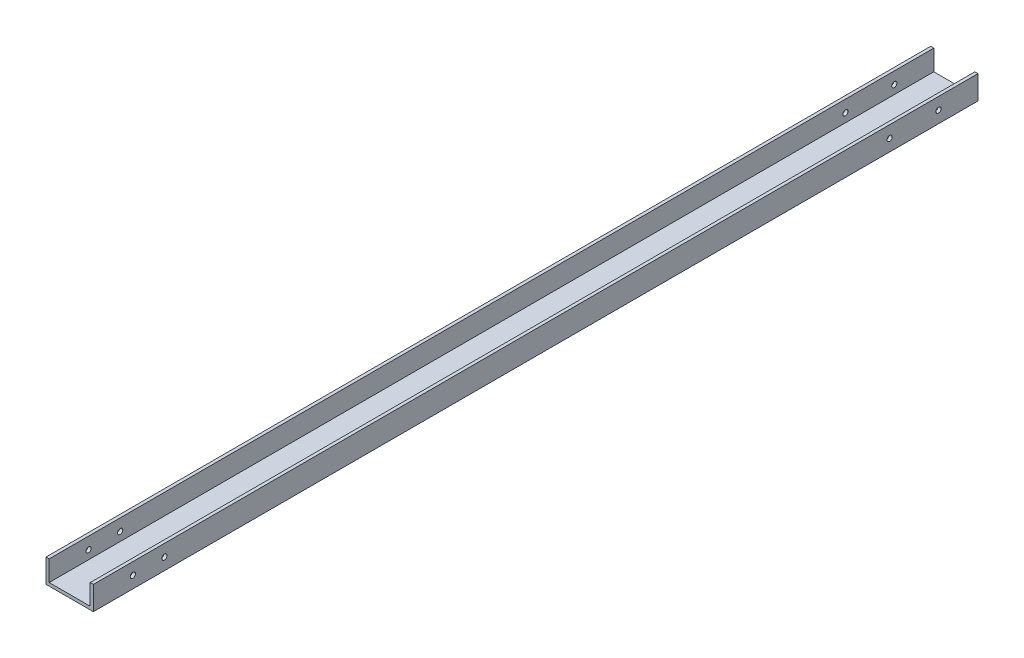
ISO-10303-21;
HEADER;
FILE_DESCRIPTION(('STEP AP214'),'2;1');
FILE_NAME('part.step','',(''),(''),'','','');
FILE_SCHEMA(('AUTOMOTIVE_DESIGN { 1 0 10303 214 1 1 1 1 }'));
ENDSEC;
DATA;
#1=APPLICATION_CONTEXT('core data for automotive mechanical design processes');
#2=APPLICATION_PROTOCOL_DEFINITION('international standard','automotive_design',2000,#1);
#3=PRODUCT_CONTEXT('',#1,'mechanical');
#4=PRODUCT('Part','Part','',(#3));
#5=PRODUCT_RELATED_PRODUCT_CATEGORY('part','',(#4));
#6=PRODUCT_DEFINITION_FORMATION('','',#4);
#7=PRODUCT_DEFINITION_CONTEXT('part definition',#1,'design');
#8=PRODUCT_DEFINITION('design','',#6,#7);
#9=PRODUCT_DEFINITION_SHAPE('','',#8);
#10=(LENGTH_UNIT() NAMED_UNIT(*) SI_UNIT(.MILLI.,.METRE.));
#11=(NAMED_UNIT(*) PLANE_ANGLE_UNIT() SI_UNIT($,.RADIAN.));
#12=(NAMED_UNIT(*) SI_UNIT($,.STERADIAN.) SOLID_ANGLE_UNIT());
#13=UNCERTAINTY_MEASURE_WITH_UNIT(LENGTH_MEASURE(1.E-05),#10,'distance_accuracy_value','');
#14=(GEOMETRIC_REPRESENTATION_CONTEXT(3) GLOBAL_UNCERTAINTY_ASSIGNED_CONTEXT((#13)) GLOBAL_UNIT_ASSIGNED_CONTEXT((#10,
#11,#12)) REPRESENTATION_CONTEXT('',''));
#15=CARTESIAN_POINT('',(0.,0.,0.));
#16=DIRECTION('',(0.,0.,1.));
#17=DIRECTION('',(1.,0.,0.));
#18=AXIS2_PLACEMENT_3D('',#15,#16,#17);
#19=CARTESIAN_POINT('',(15.,0.,560.3));
#20=DIRECTION('',(-1.,0.,0.));
#21=DIRECTION('',(0.,0.,1.));
#22=AXIS2_PLACEMENT_3D('',#19,#20,#21);
#23=PLANE('',#22);
#24=CARTESIAN_POINT('',(15.,7.5,535.3));
#25=DIRECTION('',(1.,0.,0.));
#26=DIRECTION('',(0.,0.,-1.));
#27=AXIS2_PLACEMENT_3D('',#24,#25,#26);
#28=CIRCLE('',#27,1.64999999999999);
#29=CARTESIAN_POINT('',(15.,7.5,533.65));
#30=VERTEX_POINT('',#29);
#31=EDGE_CURVE('E203',#30,#30,#28,.T.);
#32=ORIENTED_EDGE('',*,*,#31,.F.);
#33=EDGE_LOOP('',(#32));
#34=FACE_BOUND('',#33,.T.);
#35=CARTESIAN_POINT('',(15.,7.5,515.3));
#36=DIRECTION('',(1.,0.,0.));
#37=DIRECTION('',(0.,0.,-1.));
#38=AXIS2_PLACEMENT_3D('',#35,#36,#37);
#39=CIRCLE('',#38,1.64999999999999);
#40=CARTESIAN_POINT('',(15.,7.5,513.65));
#41=VERTEX_POINT('',#40);
#42=EDGE_CURVE('E197',#41,#41,#39,.T.);
#43=ORIENTED_EDGE('',*,*,#42,.F.);
#44=EDGE_LOOP('',(#43));
#45=FACE_BOUND('',#44,.T.);
#46=CARTESIAN_POINT('',(15.,7.5,25.));
#47=DIRECTION('',(1.,0.,0.));
#48=DIRECTION('',(0.,0.,-1.));
#49=AXIS2_PLACEMENT_3D('',#46,#47,#48);
#50=CIRCLE('',#49,1.65);
#51=CARTESIAN_POINT('',(15.,7.5,23.35));
#52=VERTEX_POINT('',#51);
#53=EDGE_CURVE('E185',#52,#52,#50,.T.);
#54=ORIENTED_EDGE('',*,*,#53,.F.);
#55=EDGE_LOOP('',(#54));
#56=FACE_BOUND('',#55,.T.);
#57=DIRECTION('',(0.,1.,0.));
#58=VECTOR('',#57,1.);
#59=CARTESIAN_POINT('',(15.,0.,0.));
#60=LINE('',#59,#58);
#61=CARTESIAN_POINT('',(15.,0.,0.));
#62=VERTEX_POINT('',#61);
#63=CARTESIAN_POINT('',(15.,15.,0.));
#64=VERTEX_POINT('',#63);
#65=EDGE_CURVE('E134',#62,#64,#60,.T.);
#66=ORIENTED_EDGE('',*,*,#65,.T.);
#67=DIRECTION('',(0.,0.,-1.));
#68=VECTOR('',#67,1.);
#69=CARTESIAN_POINT('',(15.,15.,560.3));
#70=LINE('',#69,#68);
#71=CARTESIAN_POINT('',(15.,15.,560.3));
#72=VERTEX_POINT('',#71);
#73=EDGE_CURVE('E45',#72,#64,#70,.T.);
#74=ORIENTED_EDGE('',*,*,#73,.F.);
#75=DIRECTION('',(0.,1.,0.));
#76=VECTOR('',#75,1.);
#77=CARTESIAN_POINT('',(15.,0.,560.3));
#78=LINE('',#77,#76);
#79=CARTESIAN_POINT('',(15.,0.,560.3));
#80=VERTEX_POINT('',#79);
#81=EDGE_CURVE('E180',#80,#72,#78,.T.);
#82=ORIENTED_EDGE('',*,*,#81,.F.);
#83=DIRECTION('',(0.,0.,-1.));
#84=VECTOR('',#83,1.);
#85=CARTESIAN_POINT('',(15.,0.,560.3));
#86=LINE('',#85,#84);
#87=EDGE_CURVE('E11',#80,#62,#86,.T.);
#88=ORIENTED_EDGE('',*,*,#87,.T.);
#89=EDGE_LOOP('',(#66,#74,#82,#88));
#90=FACE_BOUND('',#89,.T.);
#91=CARTESIAN_POINT('',(15.,7.49999999999999,56.));
#92=DIRECTION('',(1.,0.,0.));
#93=DIRECTION('',(0.,0.,-1.));
#94=AXIS2_PLACEMENT_3D('',#91,#92,#93);
#95=CIRCLE('',#94,1.65);
#96=CARTESIAN_POINT('',(15.,7.49999999999999,54.35));
#97=VERTEX_POINT('',#96);
#98=EDGE_CURVE('E191',#97,#97,#95,.T.);
#99=ORIENTED_EDGE('',*,*,#98,.F.);
#100=EDGE_LOOP('',(#99));
#101=FACE_BOUND('',#100,.T.);
#102=ADVANCED_FACE('F35',(#34,#45,#56,#90,#101),#23,.F.);
#103=CARTESIAN_POINT('',(0.,0.,560.3));
#104=DIRECTION('',(0.,1.,0.));
#105=DIRECTION('',(0.,0.,1.));
#106=AXIS2_PLACEMENT_3D('',#103,#104,#105);
#107=PLANE('',#106);
#108=DIRECTION('',(1.,0.,0.));
#109=VECTOR('',#108,1.);
#110=CARTESIAN_POINT('',(0.,0.,0.));
#111=LINE('',#110,#109);
#112=CARTESIAN_POINT('',(-15.,0.,0.));
#113=VERTEX_POINT('',#112);
#114=EDGE_CURVE('E89',#113,#62,#111,.T.);
#115=ORIENTED_EDGE('',*,*,#114,.T.);
#116=ORIENTED_EDGE('',*,*,#87,.F.);
#117=DIRECTION('',(1.,0.,0.));
#118=VECTOR('',#117,1.);
#119=CARTESIAN_POINT('',(0.,0.,560.3));
#120=LINE('',#119,#118);
#121=CARTESIAN_POINT('',(-15.,0.,560.3));
#122=VERTEX_POINT('',#121);
#123=EDGE_CURVE('E95',#122,#80,#120,.T.);
#124=ORIENTED_EDGE('',*,*,#123,.F.);
#125=DIRECTION('',(0.,0.,-1.));
#126=VECTOR('',#125,1.);
#127=CARTESIAN_POINT('',(-15.,0.,560.3));
#128=LINE('',#127,#126);
#129=EDGE_CURVE('E129',#122,#113,#128,.T.);
#130=ORIENTED_EDGE('',*,*,#129,.T.);
#131=EDGE_LOOP('',(#115,#116,#124,#130));
#132=FACE_BOUND('',#131,.T.);
#133=ADVANCED_FACE('F37',(#132),#107,.F.);
#134=CARTESIAN_POINT('',(15.,15.,560.3));
#135=DIRECTION('',(0.,-1.,0.));
#136=DIRECTION('',(0.,0.,-1.));
#137=AXIS2_PLACEMENT_3D('',#134,#135,#136);
#138=PLANE('',#137);
#139=DIRECTION('',(-1.,0.,0.));
#140=VECTOR('',#139,1.);
#141=CARTESIAN_POINT('',(15.,15.,0.));
#142=LINE('',#141,#140);
#143=CARTESIAN_POINT('',(13.,15.,0.));
#144=VERTEX_POINT('',#143);
#145=EDGE_CURVE('E137',#64,#144,#142,.T.);
#146=ORIENTED_EDGE('',*,*,#145,.T.);
#147=DIRECTION('',(0.,0.,-1.));
#148=VECTOR('',#147,1.);
#149=CARTESIAN_POINT('',(13.,15.,560.3));
#150=LINE('',#149,#148);
#151=CARTESIAN_POINT('',(13.,15.,560.3));
#152=VERTEX_POINT('',#151);
#153=EDGE_CURVE('E154',#152,#144,#150,.T.);
#154=ORIENTED_EDGE('',*,*,#153,.F.);
#155=DIRECTION('',(-1.,0.,0.));
#156=VECTOR('',#155,1.);
#157=CARTESIAN_POINT('',(15.,15.,560.3));
#158=LINE('',#157,#156);
#159=EDGE_CURVE('E164',#72,#152,#158,.T.);
#160=ORIENTED_EDGE('',*,*,#159,.F.);
#161=ORIENTED_EDGE('',*,*,#73,.T.);
#162=EDGE_LOOP('',(#146,#154,#160,#161));
#163=FACE_BOUND('',#162,.T.);
#164=ADVANCED_FACE('F162',(#163),#138,.F.);
#165=CARTESIAN_POINT('',(13.,15.,560.3));
#166=DIRECTION('',(1.,0.,0.));
#167=DIRECTION('',(0.,1.,0.));
#168=AXIS2_PLACEMENT_3D('',#165,#166,#167);
#169=PLANE('',#168);
#170=CARTESIAN_POINT('',(13.,7.5,535.3));
#171=DIRECTION('',(1.,0.,0.));
#172=DIRECTION('',(0.,1.,0.));
#173=AXIS2_PLACEMENT_3D('',#170,#171,#172);
#174=CIRCLE('',#173,1.64999999999999);
#175=CARTESIAN_POINT('',(13.,9.14999999999999,535.3));
#176=VERTEX_POINT('',#175);
#177=EDGE_CURVE('E200',#176,#176,#174,.T.);
#178=ORIENTED_EDGE('',*,*,#177,.T.);
#179=EDGE_LOOP('',(#178));
#180=FACE_BOUND('',#179,.T.);
#181=CARTESIAN_POINT('',(13.,7.5,515.3));
#182=DIRECTION('',(1.,0.,0.));
#183=DIRECTION('',(0.,1.,0.));
#184=AXIS2_PLACEMENT_3D('',#181,#182,#183);
#185=CIRCLE('',#184,1.64999999999999);
#186=CARTESIAN_POINT('',(13.,9.14999999999999,515.3));
#187=VERTEX_POINT('',#186);
#188=EDGE_CURVE('E194',#187,#187,#185,.T.);
#189=ORIENTED_EDGE('',*,*,#188,.T.);
#190=EDGE_LOOP('',(#189));
#191=FACE_BOUND('',#190,.T.);
#192=CARTESIAN_POINT('',(13.,7.49999999999999,56.));
#193=DIRECTION('',(1.,0.,0.));
#194=DIRECTION('',(0.,1.,0.));
#195=AXIS2_PLACEMENT_3D('',#192,#193,#194);
#196=CIRCLE('',#195,1.65);
#197=CARTESIAN_POINT('',(13.,9.14999999999999,56.));
#198=VERTEX_POINT('',#197);
#199=EDGE_CURVE('E188',#198,#198,#196,.T.);
#200=ORIENTED_EDGE('',*,*,#199,.T.);
#201=EDGE_LOOP('',(#200));
#202=FACE_BOUND('',#201,.T.);
#203=CARTESIAN_POINT('',(13.,7.5,25.));
#204=DIRECTION('',(1.,0.,0.));
#205=DIRECTION('',(0.,1.,0.));
#206=AXIS2_PLACEMENT_3D('',#203,#204,#205);
#207=CIRCLE('',#206,1.65);
#208=CARTESIAN_POINT('',(13.,9.15,25.));
#209=VERTEX_POINT('',#208);
#210=EDGE_CURVE('E135',#209,#209,#207,.T.);
#211=ORIENTED_EDGE('',*,*,#210,.T.);
#212=EDGE_LOOP('',(#211));
#213=FACE_BOUND('',#212,.T.);
#214=DIRECTION('',(0.,-1.,0.));
#215=VECTOR('',#214,1.);
#216=CARTESIAN_POINT('',(13.,15.,0.));
#217=LINE('',#216,#215);
#218=CARTESIAN_POINT('',(13.,2.,0.));
#219=VERTEX_POINT('',#218);
#220=EDGE_CURVE('E139',#144,#219,#217,.T.);
#221=ORIENTED_EDGE('',*,*,#220,.T.);
#222=DIRECTION('',(0.,0.,-1.));
#223=VECTOR('',#222,1.);
#224=CARTESIAN_POINT('',(13.,2.,560.3));
#225=LINE('',#224,#223);
#226=CARTESIAN_POINT('',(13.,2.,560.3));
#227=VERTEX_POINT('',#226);
#228=EDGE_CURVE('E151',#227,#219,#225,.T.);
#229=ORIENTED_EDGE('',*,*,#228,.F.);
#230=DIRECTION('',(0.,-1.,0.));
#231=VECTOR('',#230,1.);
#232=CARTESIAN_POINT('',(13.,15.,560.3));
#233=LINE('',#232,#231);
#234=EDGE_CURVE('E176',#152,#227,#233,.T.);
#235=ORIENTED_EDGE('',*,*,#234,.F.);
#236=ORIENTED_EDGE('',*,*,#153,.T.);
#237=EDGE_LOOP('',(#221,#229,#235,#236));
#238=FACE_BOUND('',#237,.T.);
#239=ADVANCED_FACE('F172',(#180,#191,#202,#213,#238),#169,.F.);
#240=CARTESIAN_POINT('',(-13.,2.,560.3));
#241=DIRECTION('',(0.,-1.,0.));
#242=DIRECTION('',(1.,0.,0.));
#243=AXIS2_PLACEMENT_3D('',#240,#241,#242);
#244=PLANE('',#243);
#245=DIRECTION('',(-1.,0.,0.));
#246=VECTOR('',#245,1.);
#247=CARTESIAN_POINT('',(-13.,2.,0.));
#248=LINE('',#247,#246);
#249=CARTESIAN_POINT('',(-13.,2.,0.));
#250=VERTEX_POINT('',#249);
#251=EDGE_CURVE('E141',#219,#250,#248,.T.);
#252=ORIENTED_EDGE('',*,*,#251,.T.);
#253=DIRECTION('',(0.,0.,-1.));
#254=VECTOR('',#253,1.);
#255=CARTESIAN_POINT('',(-13.,2.,560.3));
#256=LINE('',#255,#254);
#257=CARTESIAN_POINT('',(-13.,2.,560.3));
#258=VERTEX_POINT('',#257);
#259=EDGE_CURVE('E124',#258,#250,#256,.T.);
#260=ORIENTED_EDGE('',*,*,#259,.F.);
#261=DIRECTION('',(-1.,0.,0.));
#262=VECTOR('',#261,1.);
#263=CARTESIAN_POINT('',(-13.,2.,560.3));
#264=LINE('',#263,#262);
#265=EDGE_CURVE('E115',#227,#258,#264,.T.);
#266=ORIENTED_EDGE('',*,*,#265,.F.);
#267=ORIENTED_EDGE('',*,*,#228,.T.);
#268=EDGE_LOOP('',(#252,#260,#266,#267));
#269=FACE_BOUND('',#268,.T.);
#270=ADVANCED_FACE('F175',(#269),#244,.F.);
#271=CARTESIAN_POINT('',(-13.,15.,560.3));
#272=DIRECTION('',(-1.,0.,0.));
#273=DIRECTION('',(0.,0.,1.));
#274=AXIS2_PLACEMENT_3D('',#271,#272,#273);
#275=PLANE('',#274);
#276=CARTESIAN_POINT('',(-13.,7.49999999999999,56.));
#277=DIRECTION('',(-1.,0.,0.));
#278=DIRECTION('',(0.,0.,1.));
#279=AXIS2_PLACEMENT_3D('',#276,#277,#278);
#280=CIRCLE('',#279,1.64999999999999);
#281=CARTESIAN_POINT('',(-13.,7.49999999999999,57.65));
#282=VERTEX_POINT('',#281);
#283=EDGE_CURVE('E221',#282,#282,#280,.T.);
#284=ORIENTED_EDGE('',*,*,#283,.T.);
#285=EDGE_LOOP('',(#284));
#286=FACE_BOUND('',#285,.T.);
#287=CARTESIAN_POINT('',(-13.,7.5,25.));
#288=DIRECTION('',(-1.,0.,0.));
#289=DIRECTION('',(0.,0.,1.));
#290=AXIS2_PLACEMENT_3D('',#287,#288,#289);
#291=CIRCLE('',#290,1.64999999999999);
#292=CARTESIAN_POINT('',(-13.,7.5,26.65));
#293=VERTEX_POINT('',#292);
#294=EDGE_CURVE('E215',#293,#293,#291,.T.);
#295=ORIENTED_EDGE('',*,*,#294,.T.);
#296=EDGE_LOOP('',(#295));
#297=FACE_BOUND('',#296,.T.);
#298=CARTESIAN_POINT('',(-13.,7.5,515.3));
#299=DIRECTION('',(-1.,0.,0.));
#300=DIRECTION('',(0.,0.,1.));
#301=AXIS2_PLACEMENT_3D('',#298,#299,#300);
#302=CIRCLE('',#301,1.64999999999999);
#303=CARTESIAN_POINT('',(-13.,7.5,516.95));
#304=VERTEX_POINT('',#303);
#305=EDGE_CURVE('E39',#304,#304,#302,.T.);
#306=ORIENTED_EDGE('',*,*,#305,.T.);
#307=EDGE_LOOP('',(#306));
#308=FACE_BOUND('',#307,.T.);
#309=CARTESIAN_POINT('',(-13.,7.5,535.3));
#310=DIRECTION('',(-1.,0.,0.));
#311=DIRECTION('',(0.,0.,1.));
#312=AXIS2_PLACEMENT_3D('',#309,#310,#311);
#313=CIRCLE('',#312,1.64999999999999);
#314=CARTESIAN_POINT('',(-13.,7.5,536.95));
#315=VERTEX_POINT('',#314);
#316=EDGE_CURVE('E206',#315,#315,#313,.T.);
#317=ORIENTED_EDGE('',*,*,#316,.T.);
#318=EDGE_LOOP('',(#317));
#319=FACE_BOUND('',#318,.T.);
#320=DIRECTION('',(0.,1.,0.));
#321=VECTOR('',#320,1.);
#322=CARTESIAN_POINT('',(-13.,15.,0.));
#323=LINE('',#322,#321);
#324=CARTESIAN_POINT('',(-13.,15.,0.));
#325=VERTEX_POINT('',#324);
#326=EDGE_CURVE('E123',#250,#325,#323,.T.);
#327=ORIENTED_EDGE('',*,*,#326,.T.);
#328=DIRECTION('',(0.,0.,-1.));
#329=VECTOR('',#328,1.);
#330=CARTESIAN_POINT('',(-13.,15.,560.3));
#331=LINE('',#330,#329);
#332=CARTESIAN_POINT('',(-13.,15.,560.3));
#333=VERTEX_POINT('',#332);
#334=EDGE_CURVE('E120',#333,#325,#331,.T.);
#335=ORIENTED_EDGE('',*,*,#334,.F.);
#336=DIRECTION('',(0.,1.,0.));
#337=VECTOR('',#336,1.);
#338=CARTESIAN_POINT('',(-13.,15.,560.3));
#339=LINE('',#338,#337);
#340=EDGE_CURVE('E109',#258,#333,#339,.T.);
#341=ORIENTED_EDGE('',*,*,#340,.F.);
#342=ORIENTED_EDGE('',*,*,#259,.T.);
#343=EDGE_LOOP('',(#327,#335,#341,#342));
#344=FACE_BOUND('',#343,.T.);
#345=ADVANCED_FACE('F121',(#286,#297,#308,#319,#344),#275,.F.);
#346=CARTESIAN_POINT('',(-15.,15.,560.3));
#347=DIRECTION('',(0.,-1.,0.));
#348=DIRECTION('',(0.,0.,-1.));
#349=AXIS2_PLACEMENT_3D('',#346,#347,#348);
#350=PLANE('',#349);
#351=DIRECTION('',(-1.,0.,0.));
#352=VECTOR('',#351,1.);
#353=CARTESIAN_POINT('',(-15.,15.,0.));
#354=LINE('',#353,#352);
#355=CARTESIAN_POINT('',(-15.,15.,0.));
#356=VERTEX_POINT('',#355);
#357=EDGE_CURVE('E82',#325,#356,#354,.T.);
#358=ORIENTED_EDGE('',*,*,#357,.T.);
#359=DIRECTION('',(0.,0.,-1.));
#360=VECTOR('',#359,1.);
#361=CARTESIAN_POINT('',(-15.,15.,560.3));
#362=LINE('',#361,#360);
#363=CARTESIAN_POINT('',(-15.,15.,560.3));
#364=VERTEX_POINT('',#363);
#365=EDGE_CURVE('E125',#364,#356,#362,.T.);
#366=ORIENTED_EDGE('',*,*,#365,.F.);
#367=DIRECTION('',(-1.,0.,0.));
#368=VECTOR('',#367,1.);
#369=CARTESIAN_POINT('',(-15.,15.,560.3));
#370=LINE('',#369,#368);
#371=EDGE_CURVE('E113',#333,#364,#370,.T.);
#372=ORIENTED_EDGE('',*,*,#371,.F.);
#373=ORIENTED_EDGE('',*,*,#334,.T.);
#374=EDGE_LOOP('',(#358,#366,#372,#373));
#375=FACE_BOUND('',#374,.T.);
#376=ADVANCED_FACE('F127',(#375),#350,.F.);
#377=CARTESIAN_POINT('',(-15.,0.,560.3));
#378=DIRECTION('',(1.,0.,0.));
#379=DIRECTION('',(0.,0.,-1.));
#380=AXIS2_PLACEMENT_3D('',#377,#378,#379);
#381=PLANE('',#380);
#382=CARTESIAN_POINT('',(-15.,7.49999999999999,56.));
#383=DIRECTION('',(-1.,0.,0.));
#384=DIRECTION('',(0.,0.,1.));
#385=AXIS2_PLACEMENT_3D('',#382,#383,#384);
#386=CIRCLE('',#385,1.64999999999999);
#387=CARTESIAN_POINT('',(-15.,7.49999999999999,57.65));
#388=VERTEX_POINT('',#387);
#389=EDGE_CURVE('E224',#388,#388,#386,.T.);
#390=ORIENTED_EDGE('',*,*,#389,.F.);
#391=EDGE_LOOP('',(#390));
#392=FACE_BOUND('',#391,.T.);
#393=CARTESIAN_POINT('',(-15.,7.5,25.));
#394=DIRECTION('',(-1.,0.,0.));
#395=DIRECTION('',(0.,0.,1.));
#396=AXIS2_PLACEMENT_3D('',#393,#394,#395);
#397=CIRCLE('',#396,1.64999999999999);
#398=CARTESIAN_POINT('',(-15.,7.5,26.65));
#399=VERTEX_POINT('',#398);
#400=EDGE_CURVE('E218',#399,#399,#397,.T.);
#401=ORIENTED_EDGE('',*,*,#400,.F.);
#402=EDGE_LOOP('',(#401));
#403=FACE_BOUND('',#402,.T.);
#404=CARTESIAN_POINT('',(-15.,7.5,515.3));
#405=DIRECTION('',(-1.,0.,0.));
#406=DIRECTION('',(0.,0.,1.));
#407=AXIS2_PLACEMENT_3D('',#404,#405,#406);
#408=CIRCLE('',#407,1.64999999999999);
#409=CARTESIAN_POINT('',(-15.,7.5,516.95));
#410=VERTEX_POINT('',#409);
#411=EDGE_CURVE('E212',#410,#410,#408,.T.);
#412=ORIENTED_EDGE('',*,*,#411,.F.);
#413=EDGE_LOOP('',(#412));
#414=FACE_BOUND('',#413,.T.);
#415=CARTESIAN_POINT('',(-15.,7.5,535.3));
#416=DIRECTION('',(-1.,0.,0.));
#417=DIRECTION('',(0.,0.,1.));
#418=AXIS2_PLACEMENT_3D('',#415,#416,#417);
#419=CIRCLE('',#418,1.64999999999999);
#420=CARTESIAN_POINT('',(-15.,7.5,536.95));
#421=VERTEX_POINT('',#420);
#422=EDGE_CURVE('E209',#421,#421,#419,.T.);
#423=ORIENTED_EDGE('',*,*,#422,.F.);
#424=EDGE_LOOP('',(#423));
#425=FACE_BOUND('',#424,.T.);
#426=DIRECTION('',(0.,-1.,0.));
#427=VECTOR('',#426,1.);
#428=CARTESIAN_POINT('',(-15.,0.,0.));
#429=LINE('',#428,#427);
#430=EDGE_CURVE('E145',#356,#113,#429,.T.);
#431=ORIENTED_EDGE('',*,*,#430,.T.);
#432=ORIENTED_EDGE('',*,*,#129,.F.);
#433=DIRECTION('',(0.,-1.,0.));
#434=VECTOR('',#433,1.);
#435=CARTESIAN_POINT('',(-15.,0.,560.3));
#436=LINE('',#435,#434);
#437=EDGE_CURVE('E53',#364,#122,#436,.T.);
#438=ORIENTED_EDGE('',*,*,#437,.F.);
#439=ORIENTED_EDGE('',*,*,#365,.T.);
#440=EDGE_LOOP('',(#431,#432,#438,#439));
#441=FACE_BOUND('',#440,.T.);
#442=ADVANCED_FACE('F231',(#392,#403,#414,#425,#441),#381,.F.);
#443=CARTESIAN_POINT('',(0.,0.,560.3));
#444=DIRECTION('',(0.,0.,-1.));
#445=DIRECTION('',(-1.,0.,0.));
#446=AXIS2_PLACEMENT_3D('',#443,#444,#445);
#447=PLANE('',#446);
#448=ORIENTED_EDGE('',*,*,#123,.T.);
#449=ORIENTED_EDGE('',*,*,#81,.T.);
#450=ORIENTED_EDGE('',*,*,#159,.T.);
#451=ORIENTED_EDGE('',*,*,#234,.T.);
#452=ORIENTED_EDGE('',*,*,#265,.T.);
#453=ORIENTED_EDGE('',*,*,#340,.T.);
#454=ORIENTED_EDGE('',*,*,#371,.T.);
#455=ORIENTED_EDGE('',*,*,#437,.T.);
#456=EDGE_LOOP('',(#448,#449,#450,#451,#452,#453,#454,#455));
#457=FACE_BOUND('',#456,.T.);
#458=ADVANCED_FACE('F111',(#457),#447,.F.);
#459=CARTESIAN_POINT('',(0.,0.,0.));
#460=DIRECTION('',(0.,0.,-1.));
#461=DIRECTION('',(-1.,0.,0.));
#462=AXIS2_PLACEMENT_3D('',#459,#460,#461);
#463=PLANE('',#462);
#464=ORIENTED_EDGE('',*,*,#114,.F.);
#465=ORIENTED_EDGE('',*,*,#430,.F.);
#466=ORIENTED_EDGE('',*,*,#357,.F.);
#467=ORIENTED_EDGE('',*,*,#326,.F.);
#468=ORIENTED_EDGE('',*,*,#251,.F.);
#469=ORIENTED_EDGE('',*,*,#220,.F.);
#470=ORIENTED_EDGE('',*,*,#145,.F.);
#471=ORIENTED_EDGE('',*,*,#65,.F.);
#472=EDGE_LOOP('',(#464,#465,#466,#467,#468,#469,#470,#471));
#473=FACE_BOUND('',#472,.T.);
#474=ADVANCED_FACE('F168',(#473),#463,.T.);
#475=CARTESIAN_POINT('',(15.,7.5,25.));
#476=DIRECTION('',(1.,0.,0.));
#477=DIRECTION('',(0.,0.,-1.));
#478=AXIS2_PLACEMENT_3D('',#475,#476,#477);
#479=CYLINDRICAL_SURFACE('',#478,1.65);
#480=ORIENTED_EDGE('',*,*,#53,.T.);
#481=EDGE_LOOP('',(#480));
#482=FACE_BOUND('',#481,.T.);
#483=ORIENTED_EDGE('',*,*,#210,.F.);
#484=EDGE_LOOP('',(#483));
#485=FACE_BOUND('',#484,.T.);
#486=ADVANCED_FACE('F251',(#482,#485),#479,.F.);
#487=CARTESIAN_POINT('',(15.,7.49999999999999,56.));
#488=DIRECTION('',(1.,0.,0.));
#489=DIRECTION('',(0.,0.,-1.));
#490=AXIS2_PLACEMENT_3D('',#487,#488,#489);
#491=CYLINDRICAL_SURFACE('',#490,1.65);
#492=ORIENTED_EDGE('',*,*,#98,.T.);
#493=EDGE_LOOP('',(#492));
#494=FACE_BOUND('',#493,.T.);
#495=ORIENTED_EDGE('',*,*,#199,.F.);
#496=EDGE_LOOP('',(#495));
#497=FACE_BOUND('',#496,.T.);
#498=ADVANCED_FACE('F247',(#494,#497),#491,.F.);
#499=CARTESIAN_POINT('',(15.,7.5,515.3));
#500=DIRECTION('',(1.,0.,0.));
#501=DIRECTION('',(0.,0.,-1.));
#502=AXIS2_PLACEMENT_3D('',#499,#500,#501);
#503=CYLINDRICAL_SURFACE('',#502,1.64999999999999);
#504=ORIENTED_EDGE('',*,*,#42,.T.);
#505=EDGE_LOOP('',(#504));
#506=FACE_BOUND('',#505,.T.);
#507=ORIENTED_EDGE('',*,*,#188,.F.);
#508=EDGE_LOOP('',(#507));
#509=FACE_BOUND('',#508,.T.);
#510=ADVANCED_FACE('F250',(#506,#509),#503,.F.);
#511=CARTESIAN_POINT('',(15.,7.5,535.3));
#512=DIRECTION('',(1.,0.,0.));
#513=DIRECTION('',(0.,0.,-1.));
#514=AXIS2_PLACEMENT_3D('',#511,#512,#513);
#515=CYLINDRICAL_SURFACE('',#514,1.64999999999999);
#516=ORIENTED_EDGE('',*,*,#31,.T.);
#517=EDGE_LOOP('',(#516));
#518=FACE_BOUND('',#517,.T.);
#519=ORIENTED_EDGE('',*,*,#177,.F.);
#520=EDGE_LOOP('',(#519));
#521=FACE_BOUND('',#520,.T.);
#522=ADVANCED_FACE('F314',(#518,#521),#515,.F.);
#523=CARTESIAN_POINT('',(-15.,7.5,535.3));
#524=DIRECTION('',(-1.,0.,0.));
#525=DIRECTION('',(0.,0.,1.));
#526=AXIS2_PLACEMENT_3D('',#523,#524,#525);
#527=CYLINDRICAL_SURFACE('',#526,1.64999999999999);
#528=ORIENTED_EDGE('',*,*,#422,.T.);
#529=EDGE_LOOP('',(#528));
#530=FACE_BOUND('',#529,.T.);
#531=ORIENTED_EDGE('',*,*,#316,.F.);
#532=EDGE_LOOP('',(#531));
#533=FACE_BOUND('',#532,.T.);
#534=ADVANCED_FACE('F325',(#530,#533),#527,.F.);
#535=CARTESIAN_POINT('',(-15.,7.5,515.3));
#536=DIRECTION('',(-1.,0.,0.));
#537=DIRECTION('',(0.,0.,1.));
#538=AXIS2_PLACEMENT_3D('',#535,#536,#537);
#539=CYLINDRICAL_SURFACE('',#538,1.64999999999999);
#540=ORIENTED_EDGE('',*,*,#411,.T.);
#541=EDGE_LOOP('',(#540));
#542=FACE_BOUND('',#541,.T.);
#543=ORIENTED_EDGE('',*,*,#305,.F.);
#544=EDGE_LOOP('',(#543));
#545=FACE_BOUND('',#544,.T.);
#546=ADVANCED_FACE('F350',(#542,#545),#539,.F.);
#547=CARTESIAN_POINT('',(-15.,7.5,25.));
#548=DIRECTION('',(-1.,0.,0.));
#549=DIRECTION('',(0.,0.,1.));
#550=AXIS2_PLACEMENT_3D('',#547,#548,#549);
#551=CYLINDRICAL_SURFACE('',#550,1.64999999999999);
#552=ORIENTED_EDGE('',*,*,#400,.T.);
#553=EDGE_LOOP('',(#552));
#554=FACE_BOUND('',#553,.T.);
#555=ORIENTED_EDGE('',*,*,#294,.F.);
#556=EDGE_LOOP('',(#555));
#557=FACE_BOUND('',#556,.T.);
#558=ADVANCED_FACE('F361',(#554,#557),#551,.F.);
#559=CARTESIAN_POINT('',(-15.,7.49999999999999,56.));
#560=DIRECTION('',(-1.,0.,0.));
#561=DIRECTION('',(0.,0.,1.));
#562=AXIS2_PLACEMENT_3D('',#559,#560,#561);
#563=CYLINDRICAL_SURFACE('',#562,1.64999999999999);
#564=ORIENTED_EDGE('',*,*,#389,.T.);
#565=EDGE_LOOP('',(#564));
#566=FACE_BOUND('',#565,.T.);
#567=ORIENTED_EDGE('',*,*,#283,.F.);
#568=EDGE_LOOP('',(#567));
#569=FACE_BOUND('',#568,.T.);
#570=ADVANCED_FACE('F228',(#566,#569),#563,.F.);
#571=CLOSED_SHELL('',(#102,#133,#164,#239,#270,#345,#376,#442,#458,#474,#486,#498,#510,#522,
#534,#546,#558,#570));
#572=MANIFOLD_SOLID_BREP('B2',#571);
#573=ADVANCED_BREP_SHAPE_REPRESENTATION('',(#18,#572),#14);
#574=SHAPE_DEFINITION_REPRESENTATION(#9,#573);
ENDSEC;
END-ISO-10303-21;
